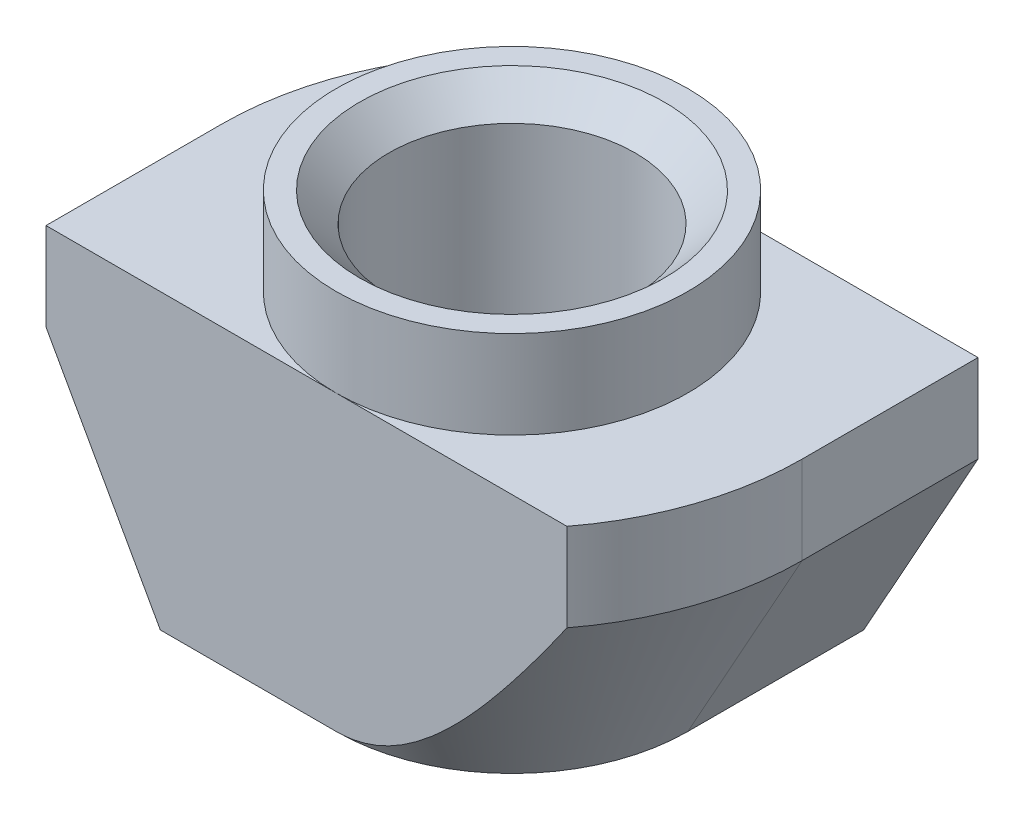
ISO-10303-21;
HEADER;
FILE_DESCRIPTION(('STEP AP214'),'2;1');
FILE_NAME('part.step','',(''),(''),'','','');
FILE_SCHEMA(('AUTOMOTIVE_DESIGN { 1 0 10303 214 1 1 1 1 }'));
ENDSEC;
DATA;
#1=APPLICATION_CONTEXT('core data for automotive mechanical design processes');
#2=APPLICATION_PROTOCOL_DEFINITION('international standard','automotive_design',2000,#1);
#3=PRODUCT_CONTEXT('',#1,'mechanical');
#4=PRODUCT('Part','Part','',(#3));
#5=PRODUCT_RELATED_PRODUCT_CATEGORY('part','',(#4));
#6=PRODUCT_DEFINITION_FORMATION('','',#4);
#7=PRODUCT_DEFINITION_CONTEXT('part definition',#1,'design');
#8=PRODUCT_DEFINITION('design','',#6,#7);
#9=PRODUCT_DEFINITION_SHAPE('','',#8);
#10=(LENGTH_UNIT() NAMED_UNIT(*) SI_UNIT(.MILLI.,.METRE.));
#11=(NAMED_UNIT(*) PLANE_ANGLE_UNIT() SI_UNIT($,.RADIAN.));
#12=(NAMED_UNIT(*) SI_UNIT($,.STERADIAN.) SOLID_ANGLE_UNIT());
#13=UNCERTAINTY_MEASURE_WITH_UNIT(LENGTH_MEASURE(1.E-05),#10,'distance_accuracy_value','');
#14=(GEOMETRIC_REPRESENTATION_CONTEXT(3) GLOBAL_UNCERTAINTY_ASSIGNED_CONTEXT((#13)) GLOBAL_UNIT_ASSIGNED_CONTEXT((#10,
#11,#12)) REPRESENTATION_CONTEXT('',''));
#15=CARTESIAN_POINT('',(0.,0.,0.));
#16=DIRECTION('',(0.,0.,1.));
#17=DIRECTION('',(1.,0.,0.));
#18=AXIS2_PLACEMENT_3D('',#15,#16,#17);
#19=CARTESIAN_POINT('',(-4.95,-1.5,3.));
#20=DIRECTION('',(1.,0.,0.));
#21=DIRECTION('',(0.,1.,0.));
#22=AXIS2_PLACEMENT_3D('',#19,#20,#21);
#23=PLANE('',#22);
#24=DIRECTION('',(0.,0.,-1.));
#25=VECTOR('',#24,1.);
#26=CARTESIAN_POINT('',(-4.95,-3.,3.));
#27=LINE('',#26,#25);
#28=CARTESIAN_POINT('',(-4.95,-3.,3.));
#29=VERTEX_POINT('',#28);
#30=CARTESIAN_POINT('',(-4.95,-3.,0.));
#31=VERTEX_POINT('',#30);
#32=EDGE_CURVE('E205',#29,#31,#27,.T.);
#33=ORIENTED_EDGE('',*,*,#32,.F.);
#34=DIRECTION('',(0.,-1.,0.));
#35=VECTOR('',#34,1.);
#36=CARTESIAN_POINT('',(-4.95,-1.5,3.));
#37=LINE('',#36,#35);
#38=CARTESIAN_POINT('',(-4.95,-1.5,3.));
#39=VERTEX_POINT('',#38);
#40=EDGE_CURVE('E134',#39,#29,#37,.T.);
#41=ORIENTED_EDGE('',*,*,#40,.F.);
#42=DIRECTION('',(0.,0.,-1.));
#43=VECTOR('',#42,1.);
#44=CARTESIAN_POINT('',(-4.95,-1.5,3.));
#45=LINE('',#44,#43);
#46=CARTESIAN_POINT('',(-4.95,-1.5,0.));
#47=VERTEX_POINT('',#46);
#48=EDGE_CURVE('E12',#39,#47,#45,.T.);
#49=ORIENTED_EDGE('',*,*,#48,.T.);
#50=DIRECTION('',(0.,1.,0.));
#51=VECTOR('',#50,1.);
#52=CARTESIAN_POINT('',(-4.95,-6.5,0.));
#53=LINE('',#52,#51);
#54=EDGE_CURVE('E206',#31,#47,#53,.T.);
#55=ORIENTED_EDGE('',*,*,#54,.F.);
#56=EDGE_LOOP('',(#33,#41,#49,#55));
#57=FACE_BOUND('',#56,.T.);
#58=ADVANCED_FACE('F38',(#57),#23,.F.);
#59=CARTESIAN_POINT('',(-4.95,-6.5,3.));
#60=DIRECTION('',(0.,1.,0.));
#61=DIRECTION('',(0.,0.,1.));
#62=AXIS2_PLACEMENT_3D('',#59,#60,#61);
#63=PLANE('',#62);
#64=CARTESIAN_POINT('',(0.,-6.5,0.));
#65=DIRECTION('',(0.,1.,0.));
#66=DIRECTION('',(0.,0.,1.));
#67=AXIS2_PLACEMENT_3D('',#64,#65,#66);
#68=CIRCLE('',#67,2.6);
#69=CARTESIAN_POINT('',(0.,-6.5,2.6));
#70=VERTEX_POINT('',#69);
#71=EDGE_CURVE('E186',#70,#70,#68,.T.);
#72=ORIENTED_EDGE('',*,*,#71,.T.);
#73=EDGE_LOOP('',(#72));
#74=FACE_BOUND('',#73,.T.);
#75=DIRECTION('',(1.,0.,0.));
#76=VECTOR('',#75,1.);
#77=CARTESIAN_POINT('',(-4.95,-6.5,3.));
#78=LINE('',#77,#76);
#79=CARTESIAN_POINT('',(-3.,-6.5,3.));
#80=VERTEX_POINT('',#79);
#81=CARTESIAN_POINT('',(0.,-6.5,3.));
#82=VERTEX_POINT('',#81);
#83=EDGE_CURVE('E132',#80,#82,#78,.T.);
#84=ORIENTED_EDGE('',*,*,#83,.F.);
#85=DIRECTION('',(0.,0.,-1.));
#86=VECTOR('',#85,1.);
#87=CARTESIAN_POINT('',(-3.,-6.5,3.));
#88=LINE('',#87,#86);
#89=CARTESIAN_POINT('',(-3.,-6.5,0.));
#90=VERTEX_POINT('',#89);
#91=EDGE_CURVE('E117',#80,#90,#88,.T.);
#92=ORIENTED_EDGE('',*,*,#91,.T.);
#93=CARTESIAN_POINT('',(0.,-6.5,0.));
#94=DIRECTION('',(0.,-1.,0.));
#95=DIRECTION('',(-1.,0.,0.));
#96=AXIS2_PLACEMENT_3D('',#93,#94,#95);
#97=CIRCLE('',#96,3.);
#98=CARTESIAN_POINT('',(0.,-6.5,-3.));
#99=VERTEX_POINT('',#98);
#100=EDGE_CURVE('E207',#90,#99,#97,.T.);
#101=ORIENTED_EDGE('',*,*,#100,.T.);
#102=DIRECTION('',(1.,0.,0.));
#103=VECTOR('',#102,1.);
#104=CARTESIAN_POINT('',(-4.95,-6.5,-3.));
#105=LINE('',#104,#103);
#106=CARTESIAN_POINT('',(3.,-6.5,-3.));
#107=VERTEX_POINT('',#106);
#108=EDGE_CURVE('E149',#99,#107,#105,.T.);
#109=ORIENTED_EDGE('',*,*,#108,.T.);
#110=DIRECTION('',(0.,0.,1.));
#111=VECTOR('',#110,1.);
#112=CARTESIAN_POINT('',(3.,-6.5,-4.95));
#113=LINE('',#112,#111);
#114=CARTESIAN_POINT('',(3.,-6.5,0.));
#115=VERTEX_POINT('',#114);
#116=EDGE_CURVE('E53',#107,#115,#113,.T.);
#117=ORIENTED_EDGE('',*,*,#116,.T.);
#118=CARTESIAN_POINT('',(0.,-6.5,0.));
#119=DIRECTION('',(0.,-1.,0.));
#120=DIRECTION('',(1.,0.,0.));
#121=AXIS2_PLACEMENT_3D('',#118,#119,#120);
#122=CIRCLE('',#121,3.);
#123=EDGE_CURVE('E138',#115,#82,#122,.T.);
#124=ORIENTED_EDGE('',*,*,#123,.T.);
#125=EDGE_LOOP('',(#84,#92,#101,#109,#117,#124));
#126=FACE_BOUND('',#125,.T.);
#127=ADVANCED_FACE('F137',(#74,#126),#63,.F.);
#128=CARTESIAN_POINT('',(4.95,-1.5,3.));
#129=DIRECTION('',(-1.,0.,0.));
#130=DIRECTION('',(0.,-1.,0.));
#131=AXIS2_PLACEMENT_3D('',#128,#129,#130);
#132=PLANE('',#131);
#133=DIRECTION('',(0.,0.,1.));
#134=VECTOR('',#133,1.);
#135=CARTESIAN_POINT('',(4.95,-3.,-4.95));
#136=LINE('',#135,#134);
#137=CARTESIAN_POINT('',(4.95,-3.,-3.));
#138=VERTEX_POINT('',#137);
#139=CARTESIAN_POINT('',(4.95,-3.,0.));
#140=VERTEX_POINT('',#139);
#141=EDGE_CURVE('E416',#138,#140,#136,.T.);
#142=ORIENTED_EDGE('',*,*,#141,.F.);
#143=DIRECTION('',(0.,1.,0.));
#144=VECTOR('',#143,1.);
#145=CARTESIAN_POINT('',(4.95,-1.5,-3.));
#146=LINE('',#145,#144);
#147=CARTESIAN_POINT('',(4.95,-1.5,-3.));
#148=VERTEX_POINT('',#147);
#149=EDGE_CURVE('E153',#138,#148,#146,.T.);
#150=ORIENTED_EDGE('',*,*,#149,.T.);
#151=DIRECTION('',(0.,0.,-1.));
#152=VECTOR('',#151,1.);
#153=CARTESIAN_POINT('',(4.95,-1.5,3.));
#154=LINE('',#153,#152);
#155=CARTESIAN_POINT('',(4.95,-1.5,0.));
#156=VERTEX_POINT('',#155);
#157=EDGE_CURVE('E46',#156,#148,#154,.T.);
#158=ORIENTED_EDGE('',*,*,#157,.F.);
#159=DIRECTION('',(0.,1.,0.));
#160=VECTOR('',#159,1.);
#161=CARTESIAN_POINT('',(4.95,-6.5,0.));
#162=LINE('',#161,#160);
#163=EDGE_CURVE('E412',#140,#156,#162,.T.);
#164=ORIENTED_EDGE('',*,*,#163,.F.);
#165=EDGE_LOOP('',(#142,#150,#158,#164));
#166=FACE_BOUND('',#165,.T.);
#167=ADVANCED_FACE('F279',(#166),#132,.F.);
#168=CARTESIAN_POINT('',(0.,0.,3.));
#169=DIRECTION('',(0.,0.,-1.));
#170=DIRECTION('',(-1.,0.,0.));
#171=AXIS2_PLACEMENT_3D('',#168,#169,#170);
#172=PLANE('',#171);
#173=DIRECTION('',(-0.486702158215268,0.873567976283815,0.));
#174=VECTOR('',#173,1.);
#175=CARTESIAN_POINT('',(-3.,-6.5,3.));
#176=LINE('',#175,#174);
#177=EDGE_CURVE('E120',#80,#29,#176,.T.);
#178=ORIENTED_EDGE('',*,*,#177,.F.);
#179=ORIENTED_EDGE('',*,*,#83,.T.);
#180=CARTESIAN_POINT('',(7.29218736422203,2.26826416058123,3.));
#181=CARTESIAN_POINT('',(7.15202643726099,2.03562955970684,3.));
#182=CARTESIAN_POINT('',(7.01145063305956,1.80324372339083,3.));
#183=CARTESIAN_POINT('',(6.72927605431873,1.3390870553258,3.));
#184=CARTESIAN_POINT('',(6.58767725705223,1.10731623739757,3.));
#185=CARTESIAN_POINT('',(6.30307250729957,0.644196571221256,3.));
#186=CARTESIAN_POINT('',(6.16006487576055,0.412848753837249,3.));
#187=CARTESIAN_POINT('',(5.8725782551589,-0.0489285339621254,3.));
#188=CARTESIAN_POINT('',(5.72809928029338,-0.279358013208818,3.));
#189=CARTESIAN_POINT('',(5.42998333301444,-0.750696257344528,3.));
#190=CARTESIAN_POINT('',(5.27625264994031,-0.99154584223635,3.));
#191=CARTESIAN_POINT('',(4.9662724467392,-1.47161769692818,3.));
#192=CARTESIAN_POINT('',(4.81002295403066,-1.71083998440184,3.));
#193=CARTESIAN_POINT('',(4.49441064676226,-2.18692387601439,3.));
#194=CARTESIAN_POINT('',(4.33505071247581,-2.42378738348171,3.));
#195=CARTESIAN_POINT('',(4.01203835877085,-2.89455453915112,3.));
#196=CARTESIAN_POINT('',(3.84838621669158,-3.12845837715035,3.));
#197=CARTESIAN_POINT('',(3.51707226528701,-3.58949232522703,3.));
#198=CARTESIAN_POINT('',(3.34947579217336,-3.81666894000739,3.));
#199=CARTESIAN_POINT('',(3.09180830724945,-4.15293869229582,3.));
#200=CARTESIAN_POINT('',(3.00479599679616,-4.26437348955312,3.));
#201=CARTESIAN_POINT('',(2.82826918660686,-4.48523867761659,3.));
#202=CARTESIAN_POINT('',(2.73875485806344,-4.59466920471461,3.));
#203=CARTESIAN_POINT('',(2.55781465063431,-4.80957028110948,3.));
#204=CARTESIAN_POINT('',(2.46642779417979,-4.91507355821246,3.));
#205=CARTESIAN_POINT('',(2.27994113072373,-5.1227406729821,3.));
#206=CARTESIAN_POINT('',(2.18484189586118,-5.22490502080909,3.));
#207=CARTESIAN_POINT('',(1.99020473430481,-5.42443729855251,3.));
#208=CARTESIAN_POINT('',(1.89067865729547,-5.52181671909356,3.));
#209=CARTESIAN_POINT('',(1.68575876963304,-5.71014723442239,3.));
#210=CARTESIAN_POINT('',(1.58036995392208,-5.8011036559539,3.));
#211=CARTESIAN_POINT('',(1.41927044824127,-5.92840727343392,3.));
#212=CARTESIAN_POINT('',(1.36644626989113,-5.96840824163117,3.));
#213=CARTESIAN_POINT('',(1.25888995653748,-6.04579751612215,3.));
#214=CARTESIAN_POINT('',(1.20415744101787,-6.08318529683766,3.));
#215=CARTESIAN_POINT('',(1.09264984190034,-6.15473469414525,3.));
#216=CARTESIAN_POINT('',(1.03587597753228,-6.18889819370232,3.));
#217=CARTESIAN_POINT('',(0.92014677130587,-6.25328006190706,3.));
#218=CARTESIAN_POINT('',(0.861191869300822,-6.28349922050961,3.));
#219=CARTESIAN_POINT('',(0.703132257697893,-6.35669114018602,3.));
#220=CARTESIAN_POINT('',(0.602124397629524,-6.39571060191382,3.));
#221=CARTESIAN_POINT('',(0.394984006224931,-6.45659335462988,3.));
#222=CARTESIAN_POINT('',(0.288859903659101,-6.47848390404385,3.));
#223=CARTESIAN_POINT('',(0.127592749433732,-6.49601455687357,3.));
#224=CARTESIAN_POINT('',(0.0732184315936915,-6.49928500887752,3.));
#225=CARTESIAN_POINT('',(-0.0356001626847598,-6.50050332792811,3.));
#226=CARTESIAN_POINT('',(-0.0900444370329192,-6.49845135047134,3.));
#227=CARTESIAN_POINT('',(-0.198468709958559,-6.48910543840041,3.));
#228=CARTESIAN_POINT('',(-0.252448767602716,-6.48181218097732,3.));
#229=CARTESIAN_POINT('',(-0.359527747369204,-6.46231551826452,3.));
#230=CARTESIAN_POINT('',(-0.412626083115481,-6.45010897171868,3.));
#231=CARTESIAN_POINT('',(-0.591972153915629,-6.4007719642132,3.));
#232=CARTESIAN_POINT('',(-0.715334992836632,-6.35282396351694,3.));
#233=CARTESIAN_POINT('',(-0.893518379079206,-6.26719815304271,3.));
#234=CARTESIAN_POINT('',(-0.951884987274442,-6.23629261434405,3.));
#235=CARTESIAN_POINT('',(-1.06647661656732,-6.17070734778166,3.));
#236=CARTESIAN_POINT('',(-1.12270188011959,-6.13602804892885,3.));
#237=CARTESIAN_POINT('',(-1.25133477481394,-6.05165334569304,3.));
#238=CARTESIAN_POINT('',(-1.32296171652013,-6.00077842714031,3.));
#239=CARTESIAN_POINT('',(-1.46308397442597,-5.89485642438521,3.));
#240=CARTESIAN_POINT('',(-1.531577757682,-5.83980733218275,3.));
#241=CARTESIAN_POINT('',(-1.66594434078125,-5.72638755144028,3.));
#242=CARTESIAN_POINT('',(-1.73181238523961,-5.66801126367299,3.));
#243=CARTESIAN_POINT('',(-1.8611955958535,-5.54869838773435,3.));
#244=CARTESIAN_POINT('',(-1.92471031995822,-5.48776132308526,3.));
#245=CARTESIAN_POINT('',(-2.11352791960345,-5.30062687502334,3.));
#246=CARTESIAN_POINT('',(-2.23572893252681,-5.17130214545234,3.));
#247=CARTESIAN_POINT('',(-2.47387471005142,-4.9073545681798,3.));
#248=CARTESIAN_POINT('',(-2.58982609456613,-4.77273759859633,3.));
#249=CARTESIAN_POINT('',(-2.8250796418439,-4.49006785104137,3.));
#250=CARTESIAN_POINT('',(-2.9440447001872,-4.34173566470912,3.));
#251=CARTESIAN_POINT('',(-3.17793553815728,-4.04191082029282,3.));
#252=CARTESIAN_POINT('',(-3.29286081948468,-3.89041777596957,3.));
#253=CARTESIAN_POINT('',(-3.51965548492199,-3.58493773524111,3.));
#254=CARTESIAN_POINT('',(-3.63152175706121,-3.43094843569306,3.));
#255=CARTESIAN_POINT('',(-3.85272920756488,-3.12116584741586,3.));
#256=CARTESIAN_POINT('',(-3.96207032255546,-2.96537251355786,3.));
#257=CARTESIAN_POINT('',(-4.17326635615867,-2.66022627529869,3.));
#258=CARTESIAN_POINT('',(-4.27522155098747,-2.51094263213963,3.));
#259=CARTESIAN_POINT('',(-4.47759808056646,-2.21133635056199,3.));
#260=CARTESIAN_POINT('',(-4.57801938587072,-2.0610136922778,3.));
#261=CARTESIAN_POINT('',(-4.77736923447432,-1.75982620861958,3.));
#262=CARTESIAN_POINT('',(-4.87630041724206,-1.60896312784132,3.));
#263=CARTESIAN_POINT('',(-5.07306092380898,-1.30653047206145,3.));
#264=CARTESIAN_POINT('',(-5.1708903021285,-1.15496093254677,3.));
#265=CARTESIAN_POINT('',(-5.26826416058119,-1.00310135688604,3.));
#266=B_SPLINE_CURVE_WITH_KNOTS('',3,(#180,#181,#182,#183,#184,#185,#186,#187,#188,#189,#190,
#191,#192,#193,#194,#195,#196,#197,#198,#199,#200,#201,#202,#203,#204,#205,#206,#207,#208,#209,
#210,#211,#212,#213,#214,#215,#216,#217,#218,#219,#220,#221,#222,#223,#224,#225,#226,#227,#228,
#229,#230,#231,#232,#233,#234,#235,#236,#237,#238,#239,#240,#241,#242,#243,#244,#245,#246,#247,
#248,#249,#250,#251,#252,#253,#254,#255,#256,#257,#258,#259,#260,#261,#262,#263,#264,#265),
.UNSPECIFIED.,.F.,.F.,(4,2,2,2,2,2,2,2,2,2,2,2,2,2,2,2,2,2,2,2,2,2,2,2,2,2,2,2,2,2,2,2,2,2,2,2,
2,2,2,2,2,2,4),(0.,0.814786640555679,1.62959143864731,2.44552615567915,3.26145300713641,
4.1186307443895,4.9757991571503,5.83220831717018,6.68856227633371,7.53533629670932,
7.95945482557749,8.38354440618669,8.80221689076438,9.22082510376435,9.63837329584292,
10.0555710366329,10.2542903521768,10.4530495208797,10.651691887454,10.8502944095848,
11.1739701157248,11.4971296807436,11.6603175186181,11.8235005889576,11.9866625792826,
12.1499290515043,12.5443793872301,12.7424404969383,12.9404791140185,13.2038509701598,
13.4673503359477,13.7313070387655,13.995313074756,14.5287806567333,15.0616715862192,
15.6320091897678,16.2024168983425,16.7733847915115,17.3443669987259,17.8866880483789,
18.4290194958655,18.9702384981704,19.5114306007397),.UNSPECIFIED.);
#267=CARTESIAN_POINT('',(3.93732142452201,-3.,3.));
#268=VERTEX_POINT('',#267);
#269=EDGE_CURVE('E216',#268,#82,#266,.T.);
#270=ORIENTED_EDGE('',*,*,#269,.F.);
#271=DIRECTION('',(0.,1.,0.));
#272=VECTOR('',#271,1.);
#273=CARTESIAN_POINT('',(3.93732142452201,-6.5,3.));
#274=LINE('',#273,#272);
#275=CARTESIAN_POINT('',(3.93732142452201,-1.5,3.));
#276=VERTEX_POINT('',#275);
#277=EDGE_CURVE('E411',#268,#276,#274,.T.);
#278=ORIENTED_EDGE('',*,*,#277,.T.);
#279=DIRECTION('',(-1.,0.,0.));
#280=VECTOR('',#279,1.);
#281=CARTESIAN_POINT('',(3.,-1.5,3.));
#282=LINE('',#281,#280);
#283=CARTESIAN_POINT('',(0.,-1.5,3.));
#284=VERTEX_POINT('',#283);
#285=EDGE_CURVE('E139',#276,#284,#282,.T.);
#286=ORIENTED_EDGE('',*,*,#285,.T.);
#287=DIRECTION('',(-1.,0.,0.));
#288=VECTOR('',#287,1.);
#289=CARTESIAN_POINT('',(-3.,-1.5,3.));
#290=LINE('',#289,#288);
#291=EDGE_CURVE('E142',#284,#39,#290,.T.);
#292=ORIENTED_EDGE('',*,*,#291,.T.);
#293=ORIENTED_EDGE('',*,*,#40,.T.);
#294=EDGE_LOOP('',(#178,#179,#270,#278,#286,#292,#293));
#295=FACE_BOUND('',#294,.T.);
#296=ADVANCED_FACE('F130',(#295),#172,.F.);
#297=CARTESIAN_POINT('',(0.,0.,-3.));
#298=DIRECTION('',(0.,0.,-1.));
#299=DIRECTION('',(-1.,0.,0.));
#300=AXIS2_PLACEMENT_3D('',#297,#298,#299);
#301=PLANE('',#300);
#302=ORIENTED_EDGE('',*,*,#108,.F.);
#303=CARTESIAN_POINT('',(5.26826416058119,-1.00310135688605,-3.));
#304=CARTESIAN_POINT('',(5.17770842267666,-1.14433082093824,-3.));
#305=CARTESIAN_POINT('',(5.08675704291128,-1.28530809460823,-3.));
#306=CARTESIAN_POINT('',(4.90391334090107,-1.56665783177356,-3.));
#307=CARTESIAN_POINT('',(4.81202098618123,-1.70703027415576,-3.));
#308=CARTESIAN_POINT('',(4.62704319683139,-1.98722482205037,-3.));
#309=CARTESIAN_POINT('',(4.53395648593774,-2.12704608597658,-3.));
#310=CARTESIAN_POINT('',(4.34650663705608,-2.40582884747355,-3.));
#311=CARTESIAN_POINT('',(4.25214351421602,-2.54479035521908,-3.));
#312=CARTESIAN_POINT('',(4.05940193587047,-2.8253160553328,-3.));
#313=CARTESIAN_POINT('',(3.96098314732628,-2.96685257911801,-3.));
#314=CARTESIAN_POINT('',(3.76222683631534,-3.24857126924169,-3.));
#315=CARTESIAN_POINT('',(3.66188934377969,-3.38875345665605,-3.));
#316=CARTESIAN_POINT('',(3.45892258515411,-3.66734255665087,-3.));
#317=CARTESIAN_POINT('',(3.35629452647723,-3.80575034668415,-3.));
#318=CARTESIAN_POINT('',(3.14814276046967,-4.08036545769983,-3.));
#319=CARTESIAN_POINT('',(3.042619234513,-4.2165729156672,-3.));
#320=CARTESIAN_POINT('',(2.82851929735822,-4.48532462656304,-3.));
#321=CARTESIAN_POINT('',(2.71996349498769,-4.6178852242394,-3.));
#322=CARTESIAN_POINT('',(2.49815282141267,-4.87915322238592,-3.));
#323=CARTESIAN_POINT('',(2.3848957535291,-5.0078587721019,-3.));
#324=CARTESIAN_POINT('',(2.15301066372248,-5.25890155599181,-3.));
#325=CARTESIAN_POINT('',(2.03442049839763,-5.38127346913871,-3.));
#326=CARTESIAN_POINT('',(1.78931926888369,-5.61772690502543,-3.));
#327=CARTESIAN_POINT('',(1.66281642622972,-5.73181677520182,-3.));
#328=CARTESIAN_POINT('',(1.4302835864886,-5.92150204662274,-3.));
#329=CARTESIAN_POINT('',(1.32650317910023,-5.99981385527404,-3.));
#330=CARTESIAN_POINT('',(1.11108968041358,-6.14537225353911,-3.));
#331=CARTESIAN_POINT('',(0.999445439755801,-6.21260266209611,-3.));
#332=CARTESIAN_POINT('',(0.765181933582771,-6.33129987847749,-3.));
#333=CARTESIAN_POINT('',(0.642407634080027,-6.38247745233208,-3.));
#334=CARTESIAN_POINT('',(0.452689794611406,-6.44019058334696,-3.));
#335=CARTESIAN_POINT('',(0.388621590580509,-6.45624318964884,-3.));
#336=CARTESIAN_POINT('',(0.259091959475528,-6.48118793446322,-3.));
#337=CARTESIAN_POINT('',(0.193631036866232,-6.49008262184477,-3.));
#338=CARTESIAN_POINT('',(0.0707300196814521,-6.49948012507423,-3.));
#339=CARTESIAN_POINT('',(0.0133611373986365,-6.50092868093494,-3.));
#340=CARTESIAN_POINT('',(-0.101217058508213,-6.49791688011482,-3.));
#341=CARTESIAN_POINT('',(-0.158426384556563,-6.49345699715873,-3.));
#342=CARTESIAN_POINT('',(-0.272160088036223,-6.47884714328322,-3.));
#343=CARTESIAN_POINT('',(-0.328683781157632,-6.46869190004173,-3.));
#344=CARTESIAN_POINT('',(-0.440556089049325,-6.44316221680924,-3.));
#345=CARTESIAN_POINT('',(-0.495903820339307,-6.42778399062821,-3.));
#346=CARTESIAN_POINT('',(-0.684766927403431,-6.36659123291341,-3.));
#347=CARTESIAN_POINT('',(-0.814577113424215,-6.30909406012431,-3.));
#348=CARTESIAN_POINT('',(-1.00148610446453,-6.20890445171883,-3.));
#349=CARTESIAN_POINT('',(-1.06260693459031,-6.17309488088303,-3.));
#350=CARTESIAN_POINT('',(-1.1824818893863,-6.09768455307717,-3.));
#351=CARTESIAN_POINT('',(-1.24123639880532,-6.05808441599374,-3.));
#352=CARTESIAN_POINT('',(-1.38322940019372,-5.9568311735784,-3.));
#353=CARTESIAN_POINT('',(-1.46522441586801,-5.89344897556831,-3.));
#354=CARTESIAN_POINT('',(-1.62529681576999,-5.76188349199647,-3.));
#355=CARTESIAN_POINT('',(-1.70337197209815,-5.69369752789675,-3.));
#356=CARTESIAN_POINT('',(-1.85635650495618,-5.55359542776792,-3.));
#357=CARTESIAN_POINT('',(-1.93125948218474,-5.48167234796869,-3.));
#358=CARTESIAN_POINT('',(-2.07829222999617,-5.33503615248439,-3.));
#359=CARTESIAN_POINT('',(-2.15042147237294,-5.26032251067657,-3.));
#360=CARTESIAN_POINT('',(-2.36495074297376,-5.03121388213734,-3.));
#361=CARTESIAN_POINT('',(-2.50377693588755,-4.87347168473288,-3.));
#362=CARTESIAN_POINT('',(-2.70681081669979,-4.63273428352104,-3.));
#363=CARTESIAN_POINT('',(-2.77358178486923,-4.55185208379063,-3.));
#364=CARTESIAN_POINT('',(-2.90565667838677,-4.3888968279252,-3.));
#365=CARTESIAN_POINT('',(-2.97096063674272,-4.30682379865246,-3.));
#366=CARTESIAN_POINT('',(-3.13919482347145,-4.09205221603655,-3.));
#367=CARTESIAN_POINT('',(-3.24114082909401,-3.95858404775206,-3.));
#368=CARTESIAN_POINT('',(-3.44244609950464,-3.68970673827622,-3.));
#369=CARTESIAN_POINT('',(-3.54180521224432,-3.55429748371676,-3.));
#370=CARTESIAN_POINT('',(-3.83678246502478,-3.1457553415188,-3.));
#371=CARTESIAN_POINT('',(-4.02926202450085,-2.87035808156589,-3.));
#372=CARTESIAN_POINT('',(-4.40875038791794,-2.31522623636694,-3.));
#373=CARTESIAN_POINT('',(-4.5957502449861,-2.0354855871704,-3.));
#374=CARTESIAN_POINT('',(-4.96553947361763,-1.47328665619275,-3.));
#375=CARTESIAN_POINT('',(-5.14832932606613,-1.19082869007316,-3.));
#376=CARTESIAN_POINT('',(-5.49737412371733,-0.644881094121442,-3.));
#377=CARTESIAN_POINT('',(-5.66385210961812,-0.38153364649588,-3.));
#378=CARTESIAN_POINT('',(-5.99470785045545,0.146489121830762,-3.));
#379=CARTESIAN_POINT('',(-6.15908552963509,0.411164489952349,-3.));
#380=CARTESIAN_POINT('',(-6.48569222606203,0.940783535343496,-3.));
#381=CARTESIAN_POINT('',(-6.64792607163562,1.20572423919326,-3.));
#382=CARTESIAN_POINT('',(-6.97101437623627,1.73642442653425,-3.));
#383=CARTESIAN_POINT('',(-7.13186891564805,2.00218386106662,-3.));
#384=CARTESIAN_POINT('',(-7.292187364222,2.26826416058119,-3.));
#385=B_SPLINE_CURVE_WITH_KNOTS('',3,(#303,#304,#305,#306,#307,#308,#309,#310,#311,#312,#313,
#314,#315,#316,#317,#318,#319,#320,#321,#322,#323,#324,#325,#326,#327,#328,#329,#330,#331,#332,
#333,#334,#335,#336,#337,#338,#339,#340,#341,#342,#343,#344,#345,#346,#347,#348,#349,#350,#351,
#352,#353,#354,#355,#356,#357,#358,#359,#360,#361,#362,#363,#364,#365,#366,#367,#368,#369,#370,
#371,#372,#373,#374,#375,#376,#377,#378,#379,#380,#381,#382,#383,#384),.UNSPECIFIED.,.F.,.F.,(4,
2,2,2,2,2,2,2,2,2,2,2,2,2,2,2,2,2,2,2,2,2,2,2,2,2,2,2,2,2,2,2,2,2,2,2,2,2,2,2,4),(0.,
0.503305226325452,1.00662788170263,1.51054259217558,2.01445132762413,2.53161295951966,
3.04876653044792,3.56565365119565,4.08250846737311,4.59644409468562,5.11062262420763,
5.62159784277377,6.13205068749595,6.5215764304842,6.91166601436244,7.30842650921261,
7.5062325471649,7.70396811700166,7.87583142250643,8.04768094924893,8.21968982414787,
8.39182365700216,8.81496460246321,9.02742027498094,9.23984126292841,9.55050241558898,
9.86133818252032,10.1727737301681,10.4842682941454,11.1143230693317,11.4289641107288,
11.7435980655719,12.2474021057537,12.7512356912026,13.7590920893869,14.7685114572478,
15.7778149471819,16.7124698096874,17.6471582900445,18.579152071234,19.5110911623844),.UNSPECIFIED.);
#386=CARTESIAN_POINT('',(-3.937321424522,-3.00000000000001,-3.));
#387=VERTEX_POINT('',#386);
#388=EDGE_CURVE('E224',#99,#387,#385,.T.);
#389=ORIENTED_EDGE('',*,*,#388,.T.);
#390=DIRECTION('',(0.,1.,0.));
#391=VECTOR('',#390,1.);
#392=CARTESIAN_POINT('',(-3.937321424522,-6.5,-3.));
#393=LINE('',#392,#391);
#394=CARTESIAN_POINT('',(-3.93732142452201,-1.5,-3.));
#395=VERTEX_POINT('',#394);
#396=EDGE_CURVE('E176',#387,#395,#393,.T.);
#397=ORIENTED_EDGE('',*,*,#396,.T.);
#398=DIRECTION('',(-1.,0.,0.));
#399=VECTOR('',#398,1.);
#400=CARTESIAN_POINT('',(-3.,-1.5,-3.));
#401=LINE('',#400,#399);
#402=CARTESIAN_POINT('',(0.,-1.5,-3.));
#403=VERTEX_POINT('',#402);
#404=EDGE_CURVE('E146',#403,#395,#401,.T.);
#405=ORIENTED_EDGE('',*,*,#404,.F.);
#406=DIRECTION('',(-1.,0.,0.));
#407=VECTOR('',#406,1.);
#408=CARTESIAN_POINT('',(3.,-1.5,-3.));
#409=LINE('',#408,#407);
#410=EDGE_CURVE('E155',#148,#403,#409,.T.);
#411=ORIENTED_EDGE('',*,*,#410,.F.);
#412=ORIENTED_EDGE('',*,*,#149,.F.);
#413=DIRECTION('',(-0.486702158215268,-0.873567976283815,0.));
#414=VECTOR('',#413,1.);
#415=CARTESIAN_POINT('',(5.0529512536988,-2.81521569848933,-3.));
#416=LINE('',#415,#414);
#417=EDGE_CURVE('E214',#138,#107,#416,.T.);
#418=ORIENTED_EDGE('',*,*,#417,.T.);
#419=EDGE_LOOP('',(#302,#389,#397,#405,#411,#412,#418));
#420=FACE_BOUND('',#419,.T.);
#421=ADVANCED_FACE('F173',(#420),#301,.T.);
#422=CARTESIAN_POINT('',(0.,-6.5,0.));
#423=DIRECTION('',(0.,1.,0.));
#424=DIRECTION('',(-1.,0.,0.));
#425=AXIS2_PLACEMENT_3D('',#422,#423,#424);
#426=CYLINDRICAL_SURFACE('',#425,4.95);
#427=CARTESIAN_POINT('',(0.,-3.,0.));
#428=DIRECTION('',(0.,-1.,0.));
#429=DIRECTION('',(-1.,0.,0.));
#430=AXIS2_PLACEMENT_3D('',#427,#428,#429);
#431=CIRCLE('',#430,4.95);
#432=EDGE_CURVE('E61',#31,#387,#431,.T.);
#433=ORIENTED_EDGE('',*,*,#432,.F.);
#434=ORIENTED_EDGE('',*,*,#54,.T.);
#435=CARTESIAN_POINT('',(0.,-1.5,0.));
#436=DIRECTION('',(0.,-1.,0.));
#437=DIRECTION('',(-1.,0.,0.));
#438=AXIS2_PLACEMENT_3D('',#435,#436,#437);
#439=CIRCLE('',#438,4.95);
#440=EDGE_CURVE('E202',#47,#395,#439,.T.);
#441=ORIENTED_EDGE('',*,*,#440,.T.);
#442=ORIENTED_EDGE('',*,*,#396,.F.);
#443=EDGE_LOOP('',(#433,#434,#441,#442));
#444=FACE_BOUND('',#443,.T.);
#445=ADVANCED_FACE('F247',(#444),#426,.T.);
#446=CARTESIAN_POINT('',(0.,-6.5,0.));
#447=DIRECTION('',(0.,1.,0.));
#448=DIRECTION('',(-1.,0.,0.));
#449=AXIS2_PLACEMENT_3D('',#446,#447,#448);
#450=CYLINDRICAL_SURFACE('',#449,4.95);
#451=CARTESIAN_POINT('',(0.,-3.,0.));
#452=DIRECTION('',(0.,-1.,0.));
#453=DIRECTION('',(1.,0.,0.));
#454=AXIS2_PLACEMENT_3D('',#451,#452,#453);
#455=CIRCLE('',#454,4.95);
#456=EDGE_CURVE('E212',#140,#268,#455,.T.);
#457=ORIENTED_EDGE('',*,*,#456,.F.);
#458=ORIENTED_EDGE('',*,*,#163,.T.);
#459=CARTESIAN_POINT('',(0.,-1.5,0.));
#460=DIRECTION('',(0.,-1.,0.));
#461=DIRECTION('',(1.,0.,0.));
#462=AXIS2_PLACEMENT_3D('',#459,#460,#461);
#463=CIRCLE('',#462,4.95);
#464=EDGE_CURVE('E167',#156,#276,#463,.T.);
#465=ORIENTED_EDGE('',*,*,#464,.T.);
#466=ORIENTED_EDGE('',*,*,#277,.F.);
#467=EDGE_LOOP('',(#457,#458,#465,#466));
#468=FACE_BOUND('',#467,.T.);
#469=ADVANCED_FACE('F250',(#468),#450,.T.);
#470=CARTESIAN_POINT('',(3.,0.,3.));
#471=DIRECTION('',(0.,-1.,0.));
#472=DIRECTION('',(0.,0.,-1.));
#473=AXIS2_PLACEMENT_3D('',#470,#471,#472);
#474=PLANE('',#473);
#475=CARTESIAN_POINT('',(0.,0.,0.));
#476=DIRECTION('',(0.,1.,0.));
#477=DIRECTION('',(0.,0.,1.));
#478=AXIS2_PLACEMENT_3D('',#475,#476,#477);
#479=CIRCLE('',#478,2.6);
#480=CARTESIAN_POINT('',(0.,0.,2.6));
#481=VERTEX_POINT('',#480);
#482=EDGE_CURVE('E189',#481,#481,#479,.T.);
#483=ORIENTED_EDGE('',*,*,#482,.F.);
#484=EDGE_LOOP('',(#483));
#485=FACE_BOUND('',#484,.T.);
#486=CARTESIAN_POINT('',(0.,0.,0.));
#487=DIRECTION('',(0.,1.,0.));
#488=DIRECTION('',(0.,0.,1.));
#489=AXIS2_PLACEMENT_3D('',#486,#487,#488);
#490=CIRCLE('',#489,3.);
#491=CARTESIAN_POINT('',(0.,0.,3.));
#492=VERTEX_POINT('',#491);
#493=EDGE_CURVE('E191',#492,#492,#490,.T.);
#494=ORIENTED_EDGE('',*,*,#493,.T.);
#495=EDGE_LOOP('',(#494));
#496=FACE_BOUND('',#495,.T.);
#497=ADVANCED_FACE('F254',(#485,#496),#474,.F.);
#498=CARTESIAN_POINT('',(-3.,-1.5,3.));
#499=DIRECTION('',(0.,-1.,0.));
#500=DIRECTION('',(1.,0.,0.));
#501=AXIS2_PLACEMENT_3D('',#498,#499,#500);
#502=PLANE('',#501);
#503=ORIENTED_EDGE('',*,*,#404,.T.);
#504=ORIENTED_EDGE('',*,*,#440,.F.);
#505=ORIENTED_EDGE('',*,*,#48,.F.);
#506=ORIENTED_EDGE('',*,*,#291,.F.);
#507=CARTESIAN_POINT('',(0.,-1.5,0.));
#508=DIRECTION('',(0.,-1.,0.));
#509=DIRECTION('',(1.,0.,0.));
#510=AXIS2_PLACEMENT_3D('',#507,#508,#509);
#511=CIRCLE('',#510,3.);
#512=EDGE_CURVE('E184',#403,#284,#511,.F.);
#513=ORIENTED_EDGE('',*,*,#512,.F.);
#514=EDGE_LOOP('',(#503,#504,#505,#506,#513));
#515=FACE_BOUND('',#514,.T.);
#516=ADVANCED_FACE('F40',(#515),#502,.F.);
#517=CARTESIAN_POINT('',(3.,-1.5,3.));
#518=DIRECTION('',(0.,-1.,0.));
#519=DIRECTION('',(1.,0.,0.));
#520=AXIS2_PLACEMENT_3D('',#517,#518,#519);
#521=PLANE('',#520);
#522=ORIENTED_EDGE('',*,*,#285,.F.);
#523=ORIENTED_EDGE('',*,*,#464,.F.);
#524=ORIENTED_EDGE('',*,*,#157,.T.);
#525=ORIENTED_EDGE('',*,*,#410,.T.);
#526=EDGE_CURVE('E182',#284,#403,#511,.F.);
#527=ORIENTED_EDGE('',*,*,#526,.F.);
#528=EDGE_LOOP('',(#522,#523,#524,#525,#527));
#529=FACE_BOUND('',#528,.T.);
#530=ADVANCED_FACE('F163',(#529),#521,.F.);
#531=CARTESIAN_POINT('',(0.,-6.,0.));
#532=DIRECTION('',(0.,-1.,0.));
#533=DIRECTION('',(0.,0.,-1.));
#534=AXIS2_PLACEMENT_3D('',#531,#532,#533);
#535=CONICAL_SURFACE('',#534,2.1,0.785398163397447);
#536=ORIENTED_EDGE('',*,*,#71,.F.);
#537=EDGE_LOOP('',(#536));
#538=FACE_BOUND('',#537,.T.);
#539=CARTESIAN_POINT('',(0.,-6.,0.));
#540=DIRECTION('',(0.,1.,0.));
#541=DIRECTION('',(0.,0.,1.));
#542=AXIS2_PLACEMENT_3D('',#539,#540,#541);
#543=CIRCLE('',#542,2.1);
#544=CARTESIAN_POINT('',(0.,-6.,2.1));
#545=VERTEX_POINT('',#544);
#546=EDGE_CURVE('E150',#545,#545,#543,.T.);
#547=ORIENTED_EDGE('',*,*,#546,.T.);
#548=EDGE_LOOP('',(#547));
#549=FACE_BOUND('',#548,.T.);
#550=ADVANCED_FACE('F265',(#538,#549),#535,.F.);
#551=CARTESIAN_POINT('',(0.,0.,0.));
#552=DIRECTION('',(0.,1.,0.));
#553=DIRECTION('',(0.,0.,1.));
#554=AXIS2_PLACEMENT_3D('',#551,#552,#553);
#555=CYLINDRICAL_SURFACE('',#554,2.1);
#556=ORIENTED_EDGE('',*,*,#546,.F.);
#557=EDGE_LOOP('',(#556));
#558=FACE_BOUND('',#557,.T.);
#559=CARTESIAN_POINT('',(0.,-0.5,0.));
#560=DIRECTION('',(0.,1.,0.));
#561=DIRECTION('',(0.,0.,1.));
#562=AXIS2_PLACEMENT_3D('',#559,#560,#561);
#563=CIRCLE('',#562,2.1);
#564=CARTESIAN_POINT('',(0.,-0.5,2.1));
#565=VERTEX_POINT('',#564);
#566=EDGE_CURVE('E197',#565,#565,#563,.T.);
#567=ORIENTED_EDGE('',*,*,#566,.T.);
#568=EDGE_LOOP('',(#567));
#569=FACE_BOUND('',#568,.T.);
#570=ADVANCED_FACE('F262',(#558,#569),#555,.F.);
#571=CARTESIAN_POINT('',(0.,0.,0.));
#572=DIRECTION('',(0.,1.,0.));
#573=DIRECTION('',(0.,0.,1.));
#574=AXIS2_PLACEMENT_3D('',#571,#572,#573);
#575=CONICAL_SURFACE('',#574,2.6,0.785398163397449);
#576=ORIENTED_EDGE('',*,*,#566,.F.);
#577=EDGE_LOOP('',(#576));
#578=FACE_BOUND('',#577,.T.);
#579=ORIENTED_EDGE('',*,*,#482,.T.);
#580=EDGE_LOOP('',(#579));
#581=FACE_BOUND('',#580,.T.);
#582=ADVANCED_FACE('F258',(#578,#581),#575,.F.);
#583=CARTESIAN_POINT('',(0.,-13.2136672310596,0.));
#584=DIRECTION('',(0.,1.,0.));
#585=DIRECTION('',(0.,0.,1.));
#586=AXIS2_PLACEMENT_3D('',#583,#584,#585);
#587=CYLINDRICAL_SURFACE('',#586,3.);
#588=ORIENTED_EDGE('',*,*,#493,.F.);
#589=EDGE_LOOP('',(#588));
#590=FACE_BOUND('',#589,.T.);
#591=ORIENTED_EDGE('',*,*,#526,.T.);
#592=ORIENTED_EDGE('',*,*,#512,.T.);
#593=EDGE_LOOP('',(#591,#592));
#594=FACE_BOUND('',#593,.T.);
#595=ADVANCED_FACE('F183',(#590,#594),#587,.T.);
#596=CARTESIAN_POINT('',(3.,-6.5,-4.95));
#597=DIRECTION('',(0.873567976283815,-0.486702158215268,0.));
#598=DIRECTION('',(0.486702158215268,0.873567976283815,0.));
#599=AXIS2_PLACEMENT_3D('',#596,#597,#598);
#600=PLANE('',#599);
#601=ORIENTED_EDGE('',*,*,#141,.T.);
#602=DIRECTION('',(0.486702158215268,0.873567976283815,0.));
#603=VECTOR('',#602,1.);
#604=CARTESIAN_POINT('',(3.,-6.5,0.));
#605=LINE('',#604,#603);
#606=EDGE_CURVE('E418',#115,#140,#605,.T.);
#607=ORIENTED_EDGE('',*,*,#606,.F.);
#608=ORIENTED_EDGE('',*,*,#116,.F.);
#609=ORIENTED_EDGE('',*,*,#417,.F.);
#610=EDGE_LOOP('',(#601,#607,#608,#609));
#611=FACE_BOUND('',#610,.T.);
#612=ADVANCED_FACE('F238',(#611),#600,.T.);
#613=CARTESIAN_POINT('',(0.,-6.5,0.));
#614=DIRECTION('',(0.,1.,0.));
#615=DIRECTION('',(0.,0.,1.));
#616=AXIS2_PLACEMENT_3D('',#613,#614,#615);
#617=CONICAL_SURFACE('',#616,3.,0.508310625010827);
#618=ORIENTED_EDGE('',*,*,#269,.T.);
#619=ORIENTED_EDGE('',*,*,#123,.F.);
#620=ORIENTED_EDGE('',*,*,#606,.T.);
#621=ORIENTED_EDGE('',*,*,#456,.T.);
#622=EDGE_LOOP('',(#618,#619,#620,#621));
#623=FACE_BOUND('',#622,.T.);
#624=ADVANCED_FACE('F234',(#623),#617,.T.);
#625=CARTESIAN_POINT('',(-3.,-6.5,3.));
#626=DIRECTION('',(-0.873567976283815,-0.486702158215269,0.));
#627=DIRECTION('',(0.486702158215269,-0.873567976283815,0.));
#628=AXIS2_PLACEMENT_3D('',#625,#626,#627);
#629=PLANE('',#628);
#630=ORIENTED_EDGE('',*,*,#32,.T.);
#631=DIRECTION('',(-0.486702158215268,0.873567976283815,0.));
#632=VECTOR('',#631,1.);
#633=CARTESIAN_POINT('',(-3.,-6.5,0.));
#634=LINE('',#633,#632);
#635=EDGE_CURVE('E122',#90,#31,#634,.T.);
#636=ORIENTED_EDGE('',*,*,#635,.F.);
#637=ORIENTED_EDGE('',*,*,#91,.F.);
#638=ORIENTED_EDGE('',*,*,#177,.T.);
#639=EDGE_LOOP('',(#630,#636,#637,#638));
#640=FACE_BOUND('',#639,.T.);
#641=ADVANCED_FACE('F119',(#640),#629,.T.);
#642=CARTESIAN_POINT('',(0.,-6.5,0.));
#643=DIRECTION('',(0.,1.,0.));
#644=DIRECTION('',(0.,0.,1.));
#645=AXIS2_PLACEMENT_3D('',#642,#643,#644);
#646=CONICAL_SURFACE('',#645,3.,0.508310625010827);
#647=ORIENTED_EDGE('',*,*,#100,.F.);
#648=ORIENTED_EDGE('',*,*,#635,.T.);
#649=ORIENTED_EDGE('',*,*,#432,.T.);
#650=ORIENTED_EDGE('',*,*,#388,.F.);
#651=EDGE_LOOP('',(#647,#648,#649,#650));
#652=FACE_BOUND('',#651,.T.);
#653=ADVANCED_FACE('F240',(#652),#646,.T.);
#654=CLOSED_SHELL('',(#58,#127,#167,#296,#421,#445,#469,#497,#516,#530,#550,#570,#582,#595,#612,
#624,#641,#653));
#655=MANIFOLD_SOLID_BREP('B2',#654);
#656=ADVANCED_BREP_SHAPE_REPRESENTATION('',(#18,#655),#14);
#657=SHAPE_DEFINITION_REPRESENTATION(#9,#656);
ENDSEC;
END-ISO-10303-21;
